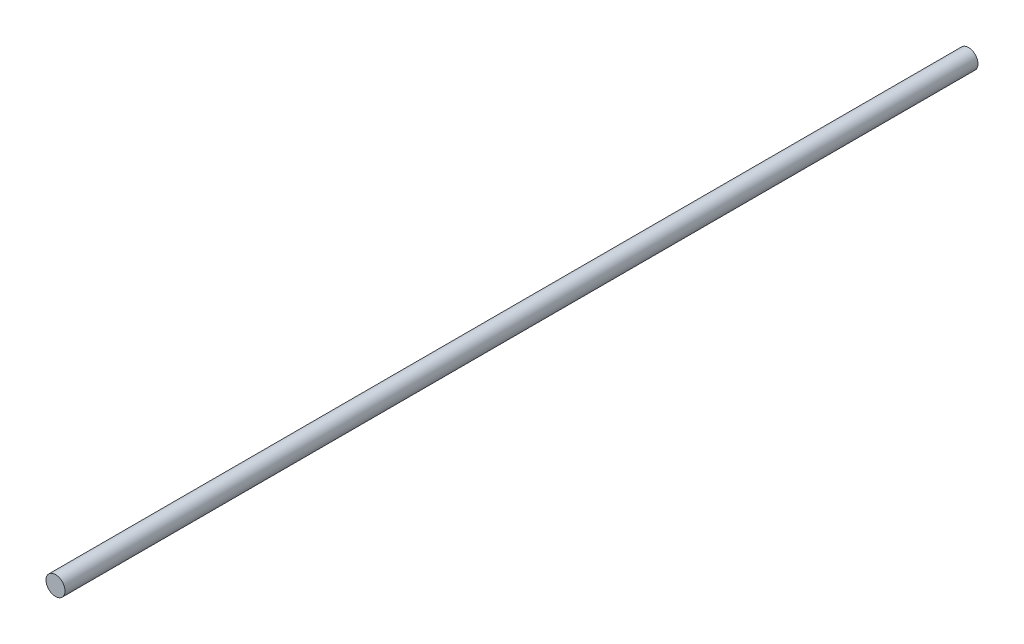
ISO-10303-21;
HEADER;
FILE_DESCRIPTION(('STEP AP214'),'2;1');
FILE_NAME('part.step','',(''),(''),'','','');
FILE_SCHEMA(('AUTOMOTIVE_DESIGN { 1 0 10303 214 1 1 1 1 }'));
ENDSEC;
DATA;
#1=APPLICATION_CONTEXT('core data for automotive mechanical design processes');
#2=APPLICATION_PROTOCOL_DEFINITION('international standard','automotive_design',2000,#1);
#3=PRODUCT_CONTEXT('',#1,'mechanical');
#4=PRODUCT('Part','Part','',(#3));
#5=PRODUCT_RELATED_PRODUCT_CATEGORY('part','',(#4));
#6=PRODUCT_DEFINITION_FORMATION('','',#4);
#7=PRODUCT_DEFINITION_CONTEXT('part definition',#1,'design');
#8=PRODUCT_DEFINITION('design','',#6,#7);
#9=PRODUCT_DEFINITION_SHAPE('','',#8);
#10=(LENGTH_UNIT() NAMED_UNIT(*) SI_UNIT(.MILLI.,.METRE.));
#11=(NAMED_UNIT(*) PLANE_ANGLE_UNIT() SI_UNIT($,.RADIAN.));
#12=(NAMED_UNIT(*) SI_UNIT($,.STERADIAN.) SOLID_ANGLE_UNIT());
#13=UNCERTAINTY_MEASURE_WITH_UNIT(LENGTH_MEASURE(1.E-05),#10,'distance_accuracy_value','');
#14=(GEOMETRIC_REPRESENTATION_CONTEXT(3) GLOBAL_UNCERTAINTY_ASSIGNED_CONTEXT((#13)) GLOBAL_UNIT_ASSIGNED_CONTEXT((#10,
#11,#12)) REPRESENTATION_CONTEXT('',''));
#15=CARTESIAN_POINT('',(0.,0.,0.));
#16=DIRECTION('',(0.,0.,1.));
#17=DIRECTION('',(1.,0.,0.));
#18=AXIS2_PLACEMENT_3D('',#15,#16,#17);
#19=CARTESIAN_POINT('',(0.,0.,152.4));
#20=DIRECTION('',(0.,0.,-1.));
#21=DIRECTION('',(-1.,0.,0.));
#22=AXIS2_PLACEMENT_3D('',#19,#20,#21);
#23=CYLINDRICAL_SURFACE('',#22,3.175);
#24=CARTESIAN_POINT('',(0.,0.,152.4));
#25=DIRECTION('',(0.,0.,1.));
#26=DIRECTION('',(1.,0.,0.));
#27=AXIS2_PLACEMENT_3D('',#24,#25,#26);
#28=CIRCLE('',#27,3.175);
#29=CARTESIAN_POINT('',(3.175,0.,152.4));
#30=VERTEX_POINT('',#29);
#31=EDGE_CURVE('E10',#30,#30,#28,.T.);
#32=ORIENTED_EDGE('',*,*,#31,.F.);
#33=EDGE_LOOP('',(#32));
#34=FACE_BOUND('',#33,.T.);
#35=CARTESIAN_POINT('',(0.,0.,-152.4));
#36=DIRECTION('',(0.,0.,1.));
#37=DIRECTION('',(1.,0.,0.));
#38=AXIS2_PLACEMENT_3D('',#35,#36,#37);
#39=CIRCLE('',#38,3.175);
#40=CARTESIAN_POINT('',(3.175,0.,-152.4));
#41=VERTEX_POINT('',#40);
#42=EDGE_CURVE('E43',#41,#41,#39,.T.);
#43=ORIENTED_EDGE('',*,*,#42,.T.);
#44=EDGE_LOOP('',(#43));
#45=FACE_BOUND('',#44,.T.);
#46=ADVANCED_FACE('F40',(#34,#45),#23,.T.);
#47=CARTESIAN_POINT('',(0.,0.,152.4));
#48=DIRECTION('',(0.,0.,1.));
#49=DIRECTION('',(1.,0.,0.));
#50=AXIS2_PLACEMENT_3D('',#47,#48,#49);
#51=PLANE('',#50);
#52=ORIENTED_EDGE('',*,*,#31,.T.);
#53=EDGE_LOOP('',(#52));
#54=FACE_BOUND('',#53,.T.);
#55=ADVANCED_FACE('F57',(#54),#51,.T.);
#56=CARTESIAN_POINT('',(0.,0.,-152.4));
#57=DIRECTION('',(0.,0.,1.));
#58=DIRECTION('',(1.,0.,0.));
#59=AXIS2_PLACEMENT_3D('',#56,#57,#58);
#60=PLANE('',#59);
#61=ORIENTED_EDGE('',*,*,#42,.F.);
#62=EDGE_LOOP('',(#61));
#63=FACE_BOUND('',#62,.T.);
#64=ADVANCED_FACE('F55',(#63),#60,.F.);
#65=CLOSED_SHELL('',(#46,#55,#64));
#66=MANIFOLD_SOLID_BREP('B2',#65);
#67=ADVANCED_BREP_SHAPE_REPRESENTATION('',(#18,#66),#14);
#68=SHAPE_DEFINITION_REPRESENTATION(#9,#67);
ENDSEC;
END-ISO-10303-21;
